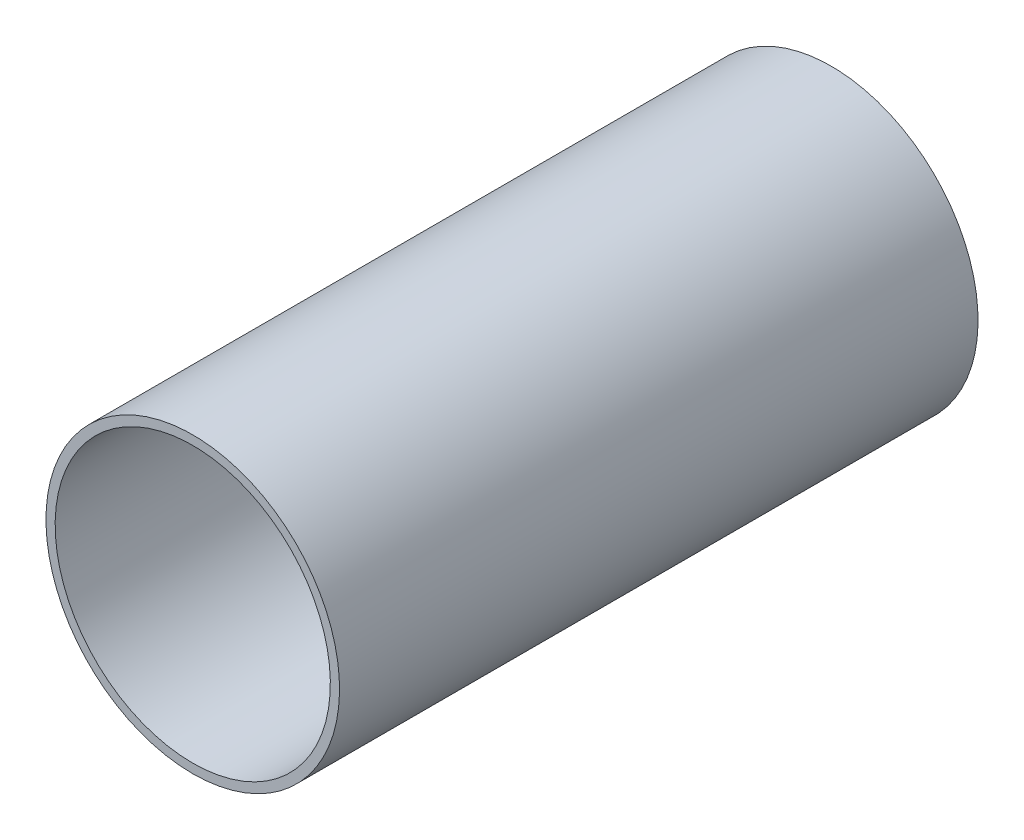
ISO-10303-21;
HEADER;
FILE_DESCRIPTION(('STEP AP214'),'2;1');
FILE_NAME('part.step','',(''),(''),'','','');
FILE_SCHEMA(('AUTOMOTIVE_DESIGN { 1 0 10303 214 1 1 1 1 }'));
ENDSEC;
DATA;
#1=APPLICATION_CONTEXT('core data for automotive mechanical design processes');
#2=APPLICATION_PROTOCOL_DEFINITION('international standard','automotive_design',2000,#1);
#3=PRODUCT_CONTEXT('',#1,'mechanical');
#4=PRODUCT('Part','Part','',(#3));
#5=PRODUCT_RELATED_PRODUCT_CATEGORY('part','',(#4));
#6=PRODUCT_DEFINITION_FORMATION('','',#4);
#7=PRODUCT_DEFINITION_CONTEXT('part definition',#1,'design');
#8=PRODUCT_DEFINITION('design','',#6,#7);
#9=PRODUCT_DEFINITION_SHAPE('','',#8);
#10=(LENGTH_UNIT() NAMED_UNIT(*) SI_UNIT(.MILLI.,.METRE.));
#11=(NAMED_UNIT(*) PLANE_ANGLE_UNIT() SI_UNIT($,.RADIAN.));
#12=(NAMED_UNIT(*) SI_UNIT($,.STERADIAN.) SOLID_ANGLE_UNIT());
#13=UNCERTAINTY_MEASURE_WITH_UNIT(LENGTH_MEASURE(1.E-05),#10,'distance_accuracy_value','');
#14=(GEOMETRIC_REPRESENTATION_CONTEXT(3) GLOBAL_UNCERTAINTY_ASSIGNED_CONTEXT((#13)) GLOBAL_UNIT_ASSIGNED_CONTEXT((#10,
#11,#12)) REPRESENTATION_CONTEXT('',''));
#15=CARTESIAN_POINT('',(0.,0.,0.));
#16=DIRECTION('',(0.,0.,1.));
#17=DIRECTION('',(1.,0.,0.));
#18=AXIS2_PLACEMENT_3D('',#15,#16,#17);
#19=CARTESIAN_POINT('',(173.228,-112.776,-0.045));
#20=DIRECTION('',(0.,0.,-1.));
#21=DIRECTION('',(0.,-1.,0.));
#22=AXIS2_PLACEMENT_3D('',#19,#20,#21);
#23=CYLINDRICAL_SURFACE('',#22,0.375);
#24=CARTESIAN_POINT('',(173.228,-112.776,-0.035));
#25=DIRECTION('',(0.,0.,-1.));
#26=DIRECTION('',(0.,-1.,0.));
#27=AXIS2_PLACEMENT_3D('',#24,#25,#26);
#28=CIRCLE('',#27,0.375);
#29=CARTESIAN_POINT('',(173.228,-113.151,-0.035));
#30=VERTEX_POINT('',#29);
#31=EDGE_CURVE('E64',#30,#30,#28,.T.);
#32=ORIENTED_EDGE('',*,*,#31,.T.);
#33=DIRECTION('',(0.,0.,1.));
#34=VECTOR('',#33,1.);
#35=CARTESIAN_POINT('',(173.228,-113.151,-0.045));
#36=LINE('',#35,#34);
#37=CARTESIAN_POINT('',(173.228,-113.151,1.705));
#38=VERTEX_POINT('',#37);
#39=EDGE_CURVE('E11',#30,#38,#36,.T.);
#40=ORIENTED_EDGE('',*,*,#39,.T.);
#41=CARTESIAN_POINT('',(173.228,-112.776,1.705));
#42=DIRECTION('',(0.,0.,-1.));
#43=DIRECTION('',(0.,-1.,0.));
#44=AXIS2_PLACEMENT_3D('',#41,#42,#43);
#45=CIRCLE('',#44,0.375);
#46=EDGE_CURVE('E25',#38,#38,#45,.T.);
#47=ORIENTED_EDGE('',*,*,#46,.F.);
#48=ORIENTED_EDGE('',*,*,#39,.F.);
#49=EDGE_LOOP('',(#32,#40,#47,#48));
#50=FACE_BOUND('',#49,.T.);
#51=ADVANCED_FACE('F17',(#50),#23,.F.);
#52=CARTESIAN_POINT('',(173.228,-113.176,1.705));
#53=DIRECTION('',(0.,0.,1.));
#54=DIRECTION('',(1.,0.,0.));
#55=AXIS2_PLACEMENT_3D('',#52,#53,#54);
#56=PLANE('',#55);
#57=ORIENTED_EDGE('',*,*,#46,.T.);
#58=EDGE_LOOP('',(#57));
#59=FACE_BOUND('',#58,.T.);
#60=CARTESIAN_POINT('',(173.228,-112.776,1.705));
#61=DIRECTION('',(0.,0.,1.));
#62=DIRECTION('',(0.,-1.,0.));
#63=AXIS2_PLACEMENT_3D('',#60,#61,#62);
#64=CIRCLE('',#63,0.4);
#65=CARTESIAN_POINT('',(173.228,-113.176,1.705));
#66=VERTEX_POINT('',#65);
#67=EDGE_CURVE('E56',#66,#66,#64,.T.);
#68=ORIENTED_EDGE('',*,*,#67,.T.);
#69=EDGE_LOOP('',(#68));
#70=FACE_BOUND('',#69,.T.);
#71=ADVANCED_FACE('F73',(#59,#70),#56,.T.);
#72=CARTESIAN_POINT('',(173.228,-113.176,-0.035));
#73=DIRECTION('',(0.,0.,1.));
#74=DIRECTION('',(1.,0.,0.));
#75=AXIS2_PLACEMENT_3D('',#72,#73,#74);
#76=PLANE('',#75);
#77=ORIENTED_EDGE('',*,*,#31,.F.);
#78=EDGE_LOOP('',(#77));
#79=FACE_BOUND('',#78,.T.);
#80=CARTESIAN_POINT('',(173.228,-112.776,-0.035));
#81=DIRECTION('',(0.,0.,1.));
#82=DIRECTION('',(0.,-1.,0.));
#83=AXIS2_PLACEMENT_3D('',#80,#81,#82);
#84=CIRCLE('',#83,0.4);
#85=CARTESIAN_POINT('',(173.228,-113.176,-0.035));
#86=VERTEX_POINT('',#85);
#87=EDGE_CURVE('E55',#86,#86,#84,.T.);
#88=ORIENTED_EDGE('',*,*,#87,.F.);
#89=EDGE_LOOP('',(#88));
#90=FACE_BOUND('',#89,.T.);
#91=ADVANCED_FACE('F82',(#79,#90),#76,.F.);
#92=CARTESIAN_POINT('',(173.228,-112.776,-0.035));
#93=DIRECTION('',(0.,0.,-1.));
#94=DIRECTION('',(0.,-1.,0.));
#95=AXIS2_PLACEMENT_3D('',#92,#93,#94);
#96=CYLINDRICAL_SURFACE('',#95,0.4);
#97=ORIENTED_EDGE('',*,*,#87,.T.);
#98=DIRECTION('',(0.,0.,1.));
#99=VECTOR('',#98,1.);
#100=CARTESIAN_POINT('',(173.228,-113.176,-0.035));
#101=LINE('',#100,#99);
#102=EDGE_CURVE('E52',#86,#66,#101,.T.);
#103=ORIENTED_EDGE('',*,*,#102,.T.);
#104=ORIENTED_EDGE('',*,*,#67,.F.);
#105=ORIENTED_EDGE('',*,*,#102,.F.);
#106=EDGE_LOOP('',(#97,#103,#104,#105));
#107=FACE_BOUND('',#106,.T.);
#108=ADVANCED_FACE('F53',(#107),#96,.T.);
#109=CLOSED_SHELL('',(#51,#71,#91,#108));
#110=MANIFOLD_SOLID_BREP('B1',#109);
#111=ADVANCED_BREP_SHAPE_REPRESENTATION('',(#18,#110),#14);
#112=SHAPE_DEFINITION_REPRESENTATION(#9,#111);
ENDSEC;
END-ISO-10303-21;
